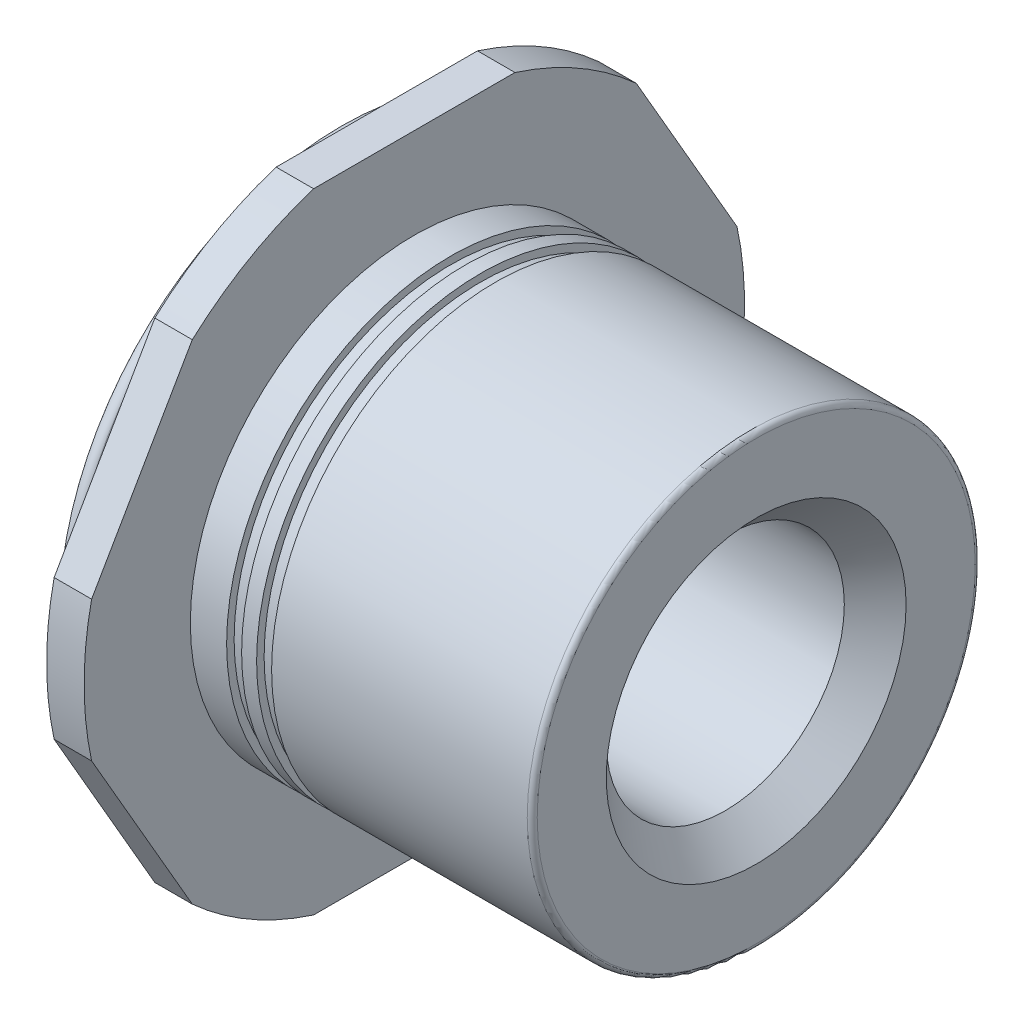
ISO-10303-21;
HEADER;
FILE_DESCRIPTION(('STEP AP214'),'2;1');
FILE_NAME('part.step','',(''),(''),'','','');
FILE_SCHEMA(('AUTOMOTIVE_DESIGN { 1 0 10303 214 1 1 1 1 }'));
ENDSEC;
DATA;
#1=APPLICATION_CONTEXT('core data for automotive mechanical design processes');
#2=APPLICATION_PROTOCOL_DEFINITION('international standard','automotive_design',2000,#1);
#3=PRODUCT_CONTEXT('',#1,'mechanical');
#4=PRODUCT('Part','Part','',(#3));
#5=PRODUCT_RELATED_PRODUCT_CATEGORY('part','',(#4));
#6=PRODUCT_DEFINITION_FORMATION('','',#4);
#7=PRODUCT_DEFINITION_CONTEXT('part definition',#1,'design');
#8=PRODUCT_DEFINITION('design','',#6,#7);
#9=PRODUCT_DEFINITION_SHAPE('','',#8);
#10=(LENGTH_UNIT() NAMED_UNIT(*) SI_UNIT(.MILLI.,.METRE.));
#11=(NAMED_UNIT(*) PLANE_ANGLE_UNIT() SI_UNIT($,.RADIAN.));
#12=(NAMED_UNIT(*) SI_UNIT($,.STERADIAN.) SOLID_ANGLE_UNIT());
#13=UNCERTAINTY_MEASURE_WITH_UNIT(LENGTH_MEASURE(1.E-05),#10,'distance_accuracy_value','');
#14=(GEOMETRIC_REPRESENTATION_CONTEXT(3) GLOBAL_UNCERTAINTY_ASSIGNED_CONTEXT((#13)) GLOBAL_UNIT_ASSIGNED_CONTEXT((#10,
#11,#12)) REPRESENTATION_CONTEXT('',''));
#15=CARTESIAN_POINT('',(0.,0.,0.));
#16=DIRECTION('',(0.,0.,1.));
#17=DIRECTION('',(1.,0.,0.));
#18=AXIS2_PLACEMENT_3D('',#15,#16,#17);
#19=CARTESIAN_POINT('',(-0.5207,2.29362,0.));
#20=DIRECTION('',(-1.,0.,0.));
#21=DIRECTION('',(0.,-1.,0.));
#22=AXIS2_PLACEMENT_3D('',#19,#20,#21);
#23=PLANE('',#22);
#24=DIRECTION('',(0.,0.,1.));
#25=VECTOR('',#24,1.);
#26=CARTESIAN_POINT('',(-0.5207,4.3688,0.));
#27=LINE('',#26,#25);
#28=CARTESIAN_POINT('',(-0.5207,4.3688,-1.39869845842483));
#29=VERTEX_POINT('',#28);
#30=CARTESIAN_POINT('',(-0.5207,4.3688,1.39869845842483));
#31=VERTEX_POINT('',#30);
#32=EDGE_CURVE('E133',#29,#31,#27,.T.);
#33=ORIENTED_EDGE('',*,*,#32,.F.);
#34=CARTESIAN_POINT('',(-0.5207,0.,0.));
#35=DIRECTION('',(-1.,0.,0.));
#36=DIRECTION('',(0.,-1.,0.));
#37=AXIS2_PLACEMENT_3D('',#34,#35,#36);
#38=CIRCLE('',#37,4.58724);
#39=CARTESIAN_POINT('',(-0.5207,3.39570839723005,-3.08414255484103));
#40=VERTEX_POINT('',#39);
#41=EDGE_CURVE('E122',#40,#29,#38,.F.);
#42=ORIENTED_EDGE('',*,*,#41,.F.);
#43=DIRECTION('',(0.,0.866025403784438,0.500000000000001));
#44=VECTOR('',#43,1.);
#45=CARTESIAN_POINT('',(-0.5207,2.1844,-3.78349178405345));
#46=LINE('',#45,#44);
#47=CARTESIAN_POINT('',(-0.5207,0.973091602769959,-4.48284101326587));
#48=VERTEX_POINT('',#47);
#49=EDGE_CURVE('E117',#48,#40,#46,.T.);
#50=ORIENTED_EDGE('',*,*,#49,.F.);
#51=CARTESIAN_POINT('',(-0.5207,0.,0.));
#52=DIRECTION('',(-1.,0.,0.));
#53=DIRECTION('',(0.,-1.,0.));
#54=AXIS2_PLACEMENT_3D('',#51,#52,#53);
#55=CIRCLE('',#54,4.58724);
#56=CARTESIAN_POINT('',(-0.5207,-0.973091602769968,-4.48284101326587));
#57=VERTEX_POINT('',#56);
#58=EDGE_CURVE('E154',#57,#48,#55,.F.);
#59=ORIENTED_EDGE('',*,*,#58,.F.);
#60=DIRECTION('',(0.,0.866025403784439,-0.5));
#61=VECTOR('',#60,1.);
#62=CARTESIAN_POINT('',(-0.5207,-2.1844,-3.78349178405346));
#63=LINE('',#62,#61);
#64=CARTESIAN_POINT('',(-0.5207,-3.39570839723003,-3.08414255484105));
#65=VERTEX_POINT('',#64);
#66=EDGE_CURVE('E155',#65,#57,#63,.T.);
#67=ORIENTED_EDGE('',*,*,#66,.F.);
#68=CARTESIAN_POINT('',(-0.5207,0.,0.));
#69=DIRECTION('',(-1.,0.,0.));
#70=DIRECTION('',(0.,-1.,0.));
#71=AXIS2_PLACEMENT_3D('',#68,#69,#70);
#72=CIRCLE('',#71,4.58724);
#73=CARTESIAN_POINT('',(-0.5207,-4.3688,-1.39869845842483));
#74=VERTEX_POINT('',#73);
#75=EDGE_CURVE('E233',#74,#65,#72,.F.);
#76=ORIENTED_EDGE('',*,*,#75,.F.);
#77=DIRECTION('',(0.,0.,-1.));
#78=VECTOR('',#77,1.);
#79=CARTESIAN_POINT('',(-0.5207,-4.3688,0.));
#80=LINE('',#79,#78);
#81=CARTESIAN_POINT('',(-0.5207,-4.3688,1.39869845842483));
#82=VERTEX_POINT('',#81);
#83=EDGE_CURVE('E161',#82,#74,#80,.T.);
#84=ORIENTED_EDGE('',*,*,#83,.F.);
#85=CARTESIAN_POINT('',(-0.5207,0.,0.));
#86=DIRECTION('',(-1.,0.,0.));
#87=DIRECTION('',(0.,-1.,0.));
#88=AXIS2_PLACEMENT_3D('',#85,#86,#87);
#89=CIRCLE('',#88,4.58724);
#90=CARTESIAN_POINT('',(-0.5207,-3.39570839723003,3.08414255484104));
#91=VERTEX_POINT('',#90);
#92=EDGE_CURVE('E235',#91,#82,#89,.F.);
#93=ORIENTED_EDGE('',*,*,#92,.F.);
#94=DIRECTION('',(0.,-0.866025403784439,-0.5));
#95=VECTOR('',#94,1.);
#96=CARTESIAN_POINT('',(-0.5207,-2.1844,3.78349178405346));
#97=LINE('',#96,#95);
#98=CARTESIAN_POINT('',(-0.5207,-0.973091602769971,4.48284101326587));
#99=VERTEX_POINT('',#98);
#100=EDGE_CURVE('E165',#99,#91,#97,.T.);
#101=ORIENTED_EDGE('',*,*,#100,.F.);
#102=CARTESIAN_POINT('',(-0.5207,0.,0.));
#103=DIRECTION('',(-1.,0.,0.));
#104=DIRECTION('',(0.,-1.,0.));
#105=AXIS2_PLACEMENT_3D('',#102,#103,#104);
#106=CIRCLE('',#105,4.58724);
#107=CARTESIAN_POINT('',(-0.5207,0.97309160276997,4.48284101326587));
#108=VERTEX_POINT('',#107);
#109=EDGE_CURVE('E237',#108,#99,#106,.F.);
#110=ORIENTED_EDGE('',*,*,#109,.F.);
#111=DIRECTION('',(0.,-0.866025403784439,0.5));
#112=VECTOR('',#111,1.);
#113=CARTESIAN_POINT('',(-0.5207,2.1844,3.78349178405346));
#114=LINE('',#113,#112);
#115=CARTESIAN_POINT('',(-0.5207,3.39570839723003,3.08414255484105));
#116=VERTEX_POINT('',#115);
#117=EDGE_CURVE('E169',#116,#108,#114,.T.);
#118=ORIENTED_EDGE('',*,*,#117,.F.);
#119=CARTESIAN_POINT('',(-0.5207,0.,0.));
#120=DIRECTION('',(-1.,0.,0.));
#121=DIRECTION('',(0.,-1.,0.));
#122=AXIS2_PLACEMENT_3D('',#119,#120,#121);
#123=CIRCLE('',#122,4.58724);
#124=EDGE_CURVE('E136',#31,#116,#123,.F.);
#125=ORIENTED_EDGE('',*,*,#124,.F.);
#126=EDGE_LOOP('',(#33,#42,#50,#59,#67,#76,#84,#93,#101,#110,#118,#125));
#127=FACE_BOUND('',#126,.T.);
#128=CARTESIAN_POINT('',(-0.5207,0.,0.));
#129=DIRECTION('',(-1.,0.,0.));
#130=DIRECTION('',(0.,0.,1.));
#131=AXIS2_PLACEMENT_3D('',#128,#129,#130);
#132=CIRCLE('',#131,3.7498428670522);
#133=CARTESIAN_POINT('',(-0.5207,0.,3.7498428670522));
#134=VERTEX_POINT('',#133);
#135=EDGE_CURVE('E160',#134,#134,#132,.T.);
#136=ORIENTED_EDGE('',*,*,#135,.F.);
#137=EDGE_LOOP('',(#136));
#138=FACE_BOUND('',#137,.T.);
#139=ADVANCED_FACE('F18',(#127,#138),#23,.T.);
#140=CARTESIAN_POINT('',(-0.347133333333333,0.,0.));
#141=DIRECTION('',(-1.,0.,0.));
#142=DIRECTION('',(0.,0.,1.));
#143=AXIS2_PLACEMENT_3D('',#140,#141,#142);
#144=CYLINDRICAL_SURFACE('',#143,3.7498428670522);
#145=CARTESIAN_POINT('',(-0.694266666698695,0.,0.));
#146=DIRECTION('',(-1.,0.,0.));
#147=DIRECTION('',(0.,0.,1.));
#148=AXIS2_PLACEMENT_3D('',#145,#146,#147);
#149=CIRCLE('',#148,3.74984286708013);
#150=CARTESIAN_POINT('',(-0.694266666698695,0.,3.74984286708013));
#151=VERTEX_POINT('',#150);
#152=EDGE_CURVE('E150',#151,#151,#149,.T.);
#153=ORIENTED_EDGE('',*,*,#152,.F.);
#154=EDGE_LOOP('',(#153));
#155=FACE_BOUND('',#154,.T.);
#156=ORIENTED_EDGE('',*,*,#135,.T.);
#157=EDGE_LOOP('',(#156));
#158=FACE_BOUND('',#157,.T.);
#159=ADVANCED_FACE('F633',(#155,#158),#144,.T.);
#160=CARTESIAN_POINT('',(-0.26035,2.1844,-3.78349178405345));
#161=DIRECTION('',(0.,0.500000000000001,-0.866025403784438));
#162=DIRECTION('',(0.,0.866025403784438,0.500000000000001));
#163=AXIS2_PLACEMENT_3D('',#160,#161,#162);
#164=PLANE('',#163);
#165=ORIENTED_EDGE('',*,*,#49,.T.);
#166=DIRECTION('',(-1.,0.,0.));
#167=VECTOR('',#166,1.);
#168=CARTESIAN_POINT('',(-0.26035,3.39570839723004,-3.08414255484103));
#169=LINE('',#168,#167);
#170=CARTESIAN_POINT('',(0.,3.39570839723005,-3.08414255484103));
#171=VERTEX_POINT('',#170);
#172=EDGE_CURVE('E129',#171,#40,#169,.T.);
#173=ORIENTED_EDGE('',*,*,#172,.F.);
#174=DIRECTION('',(0.,0.866025403784438,0.500000000000002));
#175=VECTOR('',#174,1.);
#176=CARTESIAN_POINT('',(0.,0.973091602769965,-4.48284101326587));
#177=LINE('',#176,#175);
#178=CARTESIAN_POINT('',(0.,0.973091602769964,-4.48284101326587));
#179=VERTEX_POINT('',#178);
#180=EDGE_CURVE('E153',#179,#171,#177,.T.);
#181=ORIENTED_EDGE('',*,*,#180,.F.);
#182=DIRECTION('',(-1.,0.,0.));
#183=VECTOR('',#182,1.);
#184=CARTESIAN_POINT('',(-0.26035,0.973091602769966,-4.48284101326587));
#185=LINE('',#184,#183);
#186=EDGE_CURVE('E157',#48,#179,#185,.F.);
#187=ORIENTED_EDGE('',*,*,#186,.F.);
#188=EDGE_LOOP('',(#165,#173,#181,#187));
#189=FACE_BOUND('',#188,.T.);
#190=ADVANCED_FACE('F399',(#189),#164,.T.);
#191=CARTESIAN_POINT('',(-0.26035,0.,0.));
#192=DIRECTION('',(-1.,0.,0.));
#193=DIRECTION('',(0.,-1.,0.));
#194=AXIS2_PLACEMENT_3D('',#191,#192,#193);
#195=CYLINDRICAL_SURFACE('',#194,4.58724);
#196=DIRECTION('',(-1.,0.,0.));
#197=VECTOR('',#196,1.);
#198=CARTESIAN_POINT('',(-0.26035,4.3688,-1.39869845842483));
#199=LINE('',#198,#197);
#200=CARTESIAN_POINT('',(0.,4.3688,-1.39869845842483));
#201=VERTEX_POINT('',#200);
#202=EDGE_CURVE('E127',#201,#29,#199,.T.);
#203=ORIENTED_EDGE('',*,*,#202,.F.);
#204=CARTESIAN_POINT('',(0.,0.,0.));
#205=DIRECTION('',(-1.,0.,0.));
#206=DIRECTION('',(0.,-1.,0.));
#207=AXIS2_PLACEMENT_3D('',#204,#205,#206);
#208=CIRCLE('',#207,4.58724);
#209=EDGE_CURVE('E228',#171,#201,#208,.F.);
#210=ORIENTED_EDGE('',*,*,#209,.F.);
#211=ORIENTED_EDGE('',*,*,#172,.T.);
#212=ORIENTED_EDGE('',*,*,#41,.T.);
#213=EDGE_LOOP('',(#203,#210,#211,#212));
#214=FACE_BOUND('',#213,.T.);
#215=ADVANCED_FACE('F124',(#214),#195,.T.);
#216=CARTESIAN_POINT('',(-0.26035,4.3688,0.));
#217=DIRECTION('',(0.,1.,0.));
#218=DIRECTION('',(-1.,0.,0.));
#219=AXIS2_PLACEMENT_3D('',#216,#217,#218);
#220=PLANE('',#219);
#221=ORIENTED_EDGE('',*,*,#32,.T.);
#222=DIRECTION('',(-1.,0.,0.));
#223=VECTOR('',#222,1.);
#224=CARTESIAN_POINT('',(-0.26035,4.3688,1.39869845842483));
#225=LINE('',#224,#223);
#226=CARTESIAN_POINT('',(0.,4.3688,1.39869845842483));
#227=VERTEX_POINT('',#226);
#228=EDGE_CURVE('E139',#227,#31,#225,.T.);
#229=ORIENTED_EDGE('',*,*,#228,.F.);
#230=DIRECTION('',(0.,0.,1.));
#231=VECTOR('',#230,1.);
#232=CARTESIAN_POINT('',(0.,4.3688,0.));
#233=LINE('',#232,#231);
#234=EDGE_CURVE('E143',#201,#227,#233,.T.);
#235=ORIENTED_EDGE('',*,*,#234,.F.);
#236=ORIENTED_EDGE('',*,*,#202,.T.);
#237=EDGE_LOOP('',(#221,#229,#235,#236));
#238=FACE_BOUND('',#237,.T.);
#239=ADVANCED_FACE('F141',(#238),#220,.T.);
#240=CARTESIAN_POINT('',(-0.26035,0.,0.));
#241=DIRECTION('',(-1.,0.,0.));
#242=DIRECTION('',(0.,-1.,0.));
#243=AXIS2_PLACEMENT_3D('',#240,#241,#242);
#244=CYLINDRICAL_SURFACE('',#243,4.58724);
#245=ORIENTED_EDGE('',*,*,#228,.T.);
#246=ORIENTED_EDGE('',*,*,#124,.T.);
#247=DIRECTION('',(1.,0.,0.));
#248=VECTOR('',#247,1.);
#249=CARTESIAN_POINT('',(-0.26035,3.39570839723004,3.08414255484104));
#250=LINE('',#249,#248);
#251=CARTESIAN_POINT('',(0.,3.39570839723004,3.08414255484104));
#252=VERTEX_POINT('',#251);
#253=EDGE_CURVE('E171',#252,#116,#250,.F.);
#254=ORIENTED_EDGE('',*,*,#253,.F.);
#255=CARTESIAN_POINT('',(0.,0.,0.));
#256=DIRECTION('',(-1.,0.,0.));
#257=DIRECTION('',(0.,-1.,0.));
#258=AXIS2_PLACEMENT_3D('',#255,#256,#257);
#259=CIRCLE('',#258,4.58724);
#260=EDGE_CURVE('E225',#227,#252,#259,.F.);
#261=ORIENTED_EDGE('',*,*,#260,.F.);
#262=EDGE_LOOP('',(#245,#246,#254,#261));
#263=FACE_BOUND('',#262,.T.);
#264=ADVANCED_FACE('F388',(#263),#244,.T.);
#265=CARTESIAN_POINT('',(-0.26035,2.1844,3.78349178405346));
#266=DIRECTION('',(0.,0.5,0.866025403784439));
#267=DIRECTION('',(0.,-0.866025403784439,0.5));
#268=AXIS2_PLACEMENT_3D('',#265,#266,#267);
#269=PLANE('',#268);
#270=ORIENTED_EDGE('',*,*,#117,.T.);
#271=DIRECTION('',(-1.,0.,0.));
#272=VECTOR('',#271,1.);
#273=CARTESIAN_POINT('',(-0.26035,0.973091602769963,4.48284101326587));
#274=LINE('',#273,#272);
#275=CARTESIAN_POINT('',(0.,0.973091602769961,4.48284101326587));
#276=VERTEX_POINT('',#275);
#277=EDGE_CURVE('E170',#276,#108,#274,.T.);
#278=ORIENTED_EDGE('',*,*,#277,.F.);
#279=DIRECTION('',(0.,-0.866025403784439,0.499999999999999));
#280=VECTOR('',#279,1.);
#281=CARTESIAN_POINT('',(0.,3.39570839723004,3.08414255484104));
#282=LINE('',#281,#280);
#283=EDGE_CURVE('E224',#252,#276,#282,.T.);
#284=ORIENTED_EDGE('',*,*,#283,.F.);
#285=ORIENTED_EDGE('',*,*,#253,.T.);
#286=EDGE_LOOP('',(#270,#278,#284,#285));
#287=FACE_BOUND('',#286,.T.);
#288=ADVANCED_FACE('F384',(#287),#269,.T.);
#289=CARTESIAN_POINT('',(-0.26035,0.,0.));
#290=DIRECTION('',(-1.,0.,0.));
#291=DIRECTION('',(0.,-1.,0.));
#292=AXIS2_PLACEMENT_3D('',#289,#290,#291);
#293=CYLINDRICAL_SURFACE('',#292,4.58724);
#294=ORIENTED_EDGE('',*,*,#277,.T.);
#295=ORIENTED_EDGE('',*,*,#109,.T.);
#296=DIRECTION('',(1.,0.,0.));
#297=VECTOR('',#296,1.);
#298=CARTESIAN_POINT('',(-0.26035,-0.973091602769967,4.48284101326587));
#299=LINE('',#298,#297);
#300=CARTESIAN_POINT('',(0.,-0.973091602769966,4.48284101326587));
#301=VERTEX_POINT('',#300);
#302=EDGE_CURVE('E168',#301,#99,#299,.F.);
#303=ORIENTED_EDGE('',*,*,#302,.F.);
#304=CARTESIAN_POINT('',(0.,0.,0.));
#305=DIRECTION('',(-1.,0.,0.));
#306=DIRECTION('',(0.,-1.,0.));
#307=AXIS2_PLACEMENT_3D('',#304,#305,#306);
#308=CIRCLE('',#307,4.58724);
#309=EDGE_CURVE('E221',#276,#301,#308,.F.);
#310=ORIENTED_EDGE('',*,*,#309,.F.);
#311=EDGE_LOOP('',(#294,#295,#303,#310));
#312=FACE_BOUND('',#311,.T.);
#313=ADVANCED_FACE('F393',(#312),#293,.T.);
#314=CARTESIAN_POINT('',(-0.26035,-2.1844,3.78349178405346));
#315=DIRECTION('',(0.,-0.5,0.866025403784439));
#316=DIRECTION('',(0.,-0.866025403784439,-0.5));
#317=AXIS2_PLACEMENT_3D('',#314,#315,#316);
#318=PLANE('',#317);
#319=ORIENTED_EDGE('',*,*,#100,.T.);
#320=DIRECTION('',(-1.,0.,0.));
#321=VECTOR('',#320,1.);
#322=CARTESIAN_POINT('',(-0.26035,-3.39570839723004,3.08414255484104));
#323=LINE('',#322,#321);
#324=CARTESIAN_POINT('',(0.,-3.39570839723003,3.08414255484104));
#325=VERTEX_POINT('',#324);
#326=EDGE_CURVE('E167',#325,#91,#323,.T.);
#327=ORIENTED_EDGE('',*,*,#326,.F.);
#328=DIRECTION('',(0.,-0.866025403784439,-0.499999999999999));
#329=VECTOR('',#328,1.);
#330=CARTESIAN_POINT('',(0.,-0.973091602769966,4.48284101326587));
#331=LINE('',#330,#329);
#332=EDGE_CURVE('E220',#301,#325,#331,.T.);
#333=ORIENTED_EDGE('',*,*,#332,.F.);
#334=ORIENTED_EDGE('',*,*,#302,.T.);
#335=EDGE_LOOP('',(#319,#327,#333,#334));
#336=FACE_BOUND('',#335,.T.);
#337=ADVANCED_FACE('F419',(#336),#318,.T.);
#338=CARTESIAN_POINT('',(-0.26035,0.,0.));
#339=DIRECTION('',(-1.,0.,0.));
#340=DIRECTION('',(0.,-1.,0.));
#341=AXIS2_PLACEMENT_3D('',#338,#339,#340);
#342=CYLINDRICAL_SURFACE('',#341,4.58724);
#343=ORIENTED_EDGE('',*,*,#326,.T.);
#344=ORIENTED_EDGE('',*,*,#92,.T.);
#345=DIRECTION('',(1.,0.,0.));
#346=VECTOR('',#345,1.);
#347=CARTESIAN_POINT('',(-0.26035,-4.3688,1.39869845842483));
#348=LINE('',#347,#346);
#349=CARTESIAN_POINT('',(0.,-4.3688,1.39869845842483));
#350=VERTEX_POINT('',#349);
#351=EDGE_CURVE('E164',#350,#82,#348,.F.);
#352=ORIENTED_EDGE('',*,*,#351,.F.);
#353=CARTESIAN_POINT('',(0.,0.,0.));
#354=DIRECTION('',(-1.,0.,0.));
#355=DIRECTION('',(0.,-1.,0.));
#356=AXIS2_PLACEMENT_3D('',#353,#354,#355);
#357=CIRCLE('',#356,4.58724);
#358=EDGE_CURVE('E217',#325,#350,#357,.F.);
#359=ORIENTED_EDGE('',*,*,#358,.F.);
#360=EDGE_LOOP('',(#343,#344,#352,#359));
#361=FACE_BOUND('',#360,.T.);
#362=ADVANCED_FACE('F417',(#361),#342,.T.);
#363=CARTESIAN_POINT('',(-0.26035,-4.3688,0.));
#364=DIRECTION('',(0.,-1.,0.));
#365=DIRECTION('',(0.,0.,-1.));
#366=AXIS2_PLACEMENT_3D('',#363,#364,#365);
#367=PLANE('',#366);
#368=ORIENTED_EDGE('',*,*,#83,.T.);
#369=DIRECTION('',(-1.,0.,0.));
#370=VECTOR('',#369,1.);
#371=CARTESIAN_POINT('',(-0.26035,-4.3688,-1.39869845842483));
#372=LINE('',#371,#370);
#373=CARTESIAN_POINT('',(0.,-4.3688,-1.39869845842483));
#374=VERTEX_POINT('',#373);
#375=EDGE_CURVE('E163',#374,#74,#372,.T.);
#376=ORIENTED_EDGE('',*,*,#375,.F.);
#377=DIRECTION('',(0.,0.,1.));
#378=VECTOR('',#377,1.);
#379=CARTESIAN_POINT('',(0.,-4.3688,0.));
#380=LINE('',#379,#378);
#381=EDGE_CURVE('E216',#350,#374,#380,.F.);
#382=ORIENTED_EDGE('',*,*,#381,.F.);
#383=ORIENTED_EDGE('',*,*,#351,.T.);
#384=EDGE_LOOP('',(#368,#376,#382,#383));
#385=FACE_BOUND('',#384,.T.);
#386=ADVANCED_FACE('F414',(#385),#367,.T.);
#387=CARTESIAN_POINT('',(-0.26035,0.,0.));
#388=DIRECTION('',(-1.,0.,0.));
#389=DIRECTION('',(0.,-1.,0.));
#390=AXIS2_PLACEMENT_3D('',#387,#388,#389);
#391=CYLINDRICAL_SURFACE('',#390,4.58724);
#392=ORIENTED_EDGE('',*,*,#375,.T.);
#393=ORIENTED_EDGE('',*,*,#75,.T.);
#394=DIRECTION('',(1.,0.,0.));
#395=VECTOR('',#394,1.);
#396=CARTESIAN_POINT('',(-0.26035,-3.39570839723004,-3.08414255484104));
#397=LINE('',#396,#395);
#398=CARTESIAN_POINT('',(0.,-3.39570839723004,-3.08414255484104));
#399=VERTEX_POINT('',#398);
#400=EDGE_CURVE('E158',#399,#65,#397,.F.);
#401=ORIENTED_EDGE('',*,*,#400,.F.);
#402=CARTESIAN_POINT('',(0.,0.,0.));
#403=DIRECTION('',(-1.,0.,0.));
#404=DIRECTION('',(0.,-1.,0.));
#405=AXIS2_PLACEMENT_3D('',#402,#403,#404);
#406=CIRCLE('',#405,4.58724);
#407=EDGE_CURVE('E213',#374,#399,#406,.F.);
#408=ORIENTED_EDGE('',*,*,#407,.F.);
#409=EDGE_LOOP('',(#392,#393,#401,#408));
#410=FACE_BOUND('',#409,.T.);
#411=ADVANCED_FACE('F411',(#410),#391,.T.);
#412=CARTESIAN_POINT('',(-0.26035,-2.1844,-3.78349178405346));
#413=DIRECTION('',(0.,-0.5,-0.866025403784439));
#414=DIRECTION('',(0.,0.866025403784439,-0.5));
#415=AXIS2_PLACEMENT_3D('',#412,#413,#414);
#416=PLANE('',#415);
#417=ORIENTED_EDGE('',*,*,#66,.T.);
#418=DIRECTION('',(-1.,0.,0.));
#419=VECTOR('',#418,1.);
#420=CARTESIAN_POINT('',(-0.26035,-0.973091602769961,-4.48284101326587));
#421=LINE('',#420,#419);
#422=CARTESIAN_POINT('',(0.,-0.973091602769957,-4.48284101326587));
#423=VERTEX_POINT('',#422);
#424=EDGE_CURVE('E232',#423,#57,#421,.T.);
#425=ORIENTED_EDGE('',*,*,#424,.F.);
#426=DIRECTION('',(0.,0.866025403784439,-0.499999999999999));
#427=VECTOR('',#426,1.);
#428=CARTESIAN_POINT('',(0.,-3.39570839723004,-3.08414255484104));
#429=LINE('',#428,#427);
#430=EDGE_CURVE('E212',#399,#423,#429,.T.);
#431=ORIENTED_EDGE('',*,*,#430,.F.);
#432=ORIENTED_EDGE('',*,*,#400,.T.);
#433=EDGE_LOOP('',(#417,#425,#431,#432));
#434=FACE_BOUND('',#433,.T.);
#435=ADVANCED_FACE('F408',(#434),#416,.T.);
#436=CARTESIAN_POINT('',(-0.26035,0.,0.));
#437=DIRECTION('',(-1.,0.,0.));
#438=DIRECTION('',(0.,-1.,0.));
#439=AXIS2_PLACEMENT_3D('',#436,#437,#438);
#440=CYLINDRICAL_SURFACE('',#439,4.58724);
#441=ORIENTED_EDGE('',*,*,#424,.T.);
#442=ORIENTED_EDGE('',*,*,#58,.T.);
#443=ORIENTED_EDGE('',*,*,#186,.T.);
#444=CARTESIAN_POINT('',(0.,0.,0.));
#445=DIRECTION('',(-1.,0.,0.));
#446=DIRECTION('',(0.,-1.,0.));
#447=AXIS2_PLACEMENT_3D('',#444,#445,#446);
#448=CIRCLE('',#447,4.58724);
#449=EDGE_CURVE('E209',#423,#179,#448,.F.);
#450=ORIENTED_EDGE('',*,*,#449,.F.);
#451=EDGE_LOOP('',(#441,#442,#443,#450));
#452=FACE_BOUND('',#451,.T.);
#453=ADVANCED_FACE('F401',(#452),#440,.T.);
#454=CARTESIAN_POINT('',(-0.863621899782174,0.,0.));
#455=DIRECTION('',(-1.,0.,0.));
#456=DIRECTION('',(0.,0.,1.));
#457=AXIS2_PLACEMENT_3D('',#454,#455,#456);
#458=CONICAL_SURFACE('',#457,3.91919810016361,0.785398163397448);
#459=CARTESIAN_POINT('',(-0.863621899807235,0.,0.));
#460=DIRECTION('',(-1.,0.,0.));
#461=DIRECTION('',(0.,0.,1.));
#462=AXIS2_PLACEMENT_3D('',#459,#460,#461);
#463=CIRCLE('',#462,3.91919810019277);
#464=CARTESIAN_POINT('',(-0.863621899807235,0.,3.91919810019277));
#465=VERTEX_POINT('',#464);
#466=EDGE_CURVE('E208',#465,#465,#463,.T.);
#467=ORIENTED_EDGE('',*,*,#466,.F.);
#468=EDGE_LOOP('',(#467));
#469=FACE_BOUND('',#468,.T.);
#470=ORIENTED_EDGE('',*,*,#152,.T.);
#471=EDGE_LOOP('',(#470));
#472=FACE_BOUND('',#471,.T.);
#473=ADVANCED_FACE('F494',(#469,#472),#458,.T.);
#474=CARTESIAN_POINT('',(0.,2.29362,0.));
#475=DIRECTION('',(1.,0.,0.));
#476=DIRECTION('',(0.,1.,0.));
#477=AXIS2_PLACEMENT_3D('',#474,#475,#476);
#478=PLANE('',#477);
#479=ORIENTED_EDGE('',*,*,#430,.T.);
#480=ORIENTED_EDGE('',*,*,#449,.T.);
#481=ORIENTED_EDGE('',*,*,#180,.T.);
#482=ORIENTED_EDGE('',*,*,#209,.T.);
#483=ORIENTED_EDGE('',*,*,#234,.T.);
#484=ORIENTED_EDGE('',*,*,#260,.T.);
#485=ORIENTED_EDGE('',*,*,#283,.T.);
#486=ORIENTED_EDGE('',*,*,#309,.T.);
#487=ORIENTED_EDGE('',*,*,#332,.T.);
#488=ORIENTED_EDGE('',*,*,#358,.T.);
#489=ORIENTED_EDGE('',*,*,#381,.T.);
#490=ORIENTED_EDGE('',*,*,#407,.T.);
#491=EDGE_LOOP('',(#479,#480,#481,#482,#483,#484,#485,#486,#487,#488,#489,#490));
#492=FACE_BOUND('',#491,.T.);
#493=CARTESIAN_POINT('',(0.,0.,0.));
#494=DIRECTION('',(-1.,0.,0.));
#495=DIRECTION('',(0.,0.,1.));
#496=AXIS2_PLACEMENT_3D('',#493,#494,#495);
#497=CIRCLE('',#496,3.1115);
#498=CARTESIAN_POINT('',(0.,0.,3.1115));
#499=VERTEX_POINT('',#498);
#500=EDGE_CURVE('E205',#499,#499,#497,.F.);
#501=ORIENTED_EDGE('',*,*,#500,.F.);
#502=EDGE_LOOP('',(#501));
#503=FACE_BOUND('',#502,.T.);
#504=ADVANCED_FACE('F396',(#492,#503),#478,.T.);
#505=CARTESIAN_POINT('',(2.34018666666667,0.,0.));
#506=DIRECTION('',(-1.,0.,0.));
#507=DIRECTION('',(0.,0.,1.));
#508=AXIS2_PLACEMENT_3D('',#505,#506,#507);
#509=CYLINDRICAL_SURFACE('',#508,3.1115);
#510=CARTESIAN_POINT('',(0.50419,0.,0.));
#511=DIRECTION('',(-1.,0.,0.));
#512=DIRECTION('',(0.,0.,1.));
#513=AXIS2_PLACEMENT_3D('',#510,#511,#512);
#514=CIRCLE('',#513,3.1115);
#515=CARTESIAN_POINT('',(0.50419,0.,3.1115));
#516=VERTEX_POINT('',#515);
#517=EDGE_CURVE('E201',#516,#516,#514,.T.);
#518=ORIENTED_EDGE('',*,*,#517,.T.);
#519=EDGE_LOOP('',(#518));
#520=FACE_BOUND('',#519,.T.);
#521=ORIENTED_EDGE('',*,*,#500,.T.);
#522=EDGE_LOOP('',(#521));
#523=FACE_BOUND('',#522,.T.);
#524=ADVANCED_FACE('F341',(#520,#523),#509,.T.);
#525=CARTESIAN_POINT('',(-0.93726,0.,0.));
#526=DIRECTION('',(-1.,0.,0.));
#527=DIRECTION('',(0.,0.,1.));
#528=AXIS2_PLACEMENT_3D('',#525,#526,#527);
#529=TOROIDAL_SURFACE('',#528,3.84556,0.104139999999999);
#530=ORIENTED_EDGE('',*,*,#466,.T.);
#531=EDGE_LOOP('',(#530));
#532=FACE_BOUND('',#531,.T.);
#533=CARTESIAN_POINT('',(-1.0414,0.,0.));
#534=DIRECTION('',(1.,0.,0.));
#535=DIRECTION('',(0.,0.,-1.));
#536=AXIS2_PLACEMENT_3D('',#533,#534,#535);
#537=CIRCLE('',#536,3.84556);
#538=CARTESIAN_POINT('',(-1.0414,0.,3.84556));
#539=VERTEX_POINT('',#538);
#540=CARTESIAN_POINT('',(-1.0414,0.,-3.84556));
#541=VERTEX_POINT('',#540);
#542=EDGE_CURVE('E204',#539,#541,#537,.F.);
#543=ORIENTED_EDGE('',*,*,#542,.F.);
#544=CARTESIAN_POINT('',(-1.0414,0.,0.));
#545=DIRECTION('',(1.,0.,0.));
#546=DIRECTION('',(0.,0.,1.));
#547=AXIS2_PLACEMENT_3D('',#544,#545,#546);
#548=CIRCLE('',#547,3.84556);
#549=EDGE_CURVE('E200',#541,#539,#548,.F.);
#550=ORIENTED_EDGE('',*,*,#549,.F.);
#551=EDGE_LOOP('',(#543,#550));
#552=FACE_BOUND('',#551,.T.);
#553=ADVANCED_FACE('F337',(#532,#552),#529,.T.);
#554=CARTESIAN_POINT('',(0.50419,0.,3.05943));
#555=DIRECTION('',(-1.,0.,0.));
#556=DIRECTION('',(0.,0.,1.));
#557=AXIS2_PLACEMENT_3D('',#554,#555,#556);
#558=PLANE('',#557);
#559=ORIENTED_EDGE('',*,*,#517,.F.);
#560=EDGE_LOOP('',(#559));
#561=FACE_BOUND('',#560,.T.);
#562=CARTESIAN_POINT('',(0.504190000000001,0.,0.));
#563=DIRECTION('',(-1.,0.,0.));
#564=DIRECTION('',(0.,0.,1.));
#565=AXIS2_PLACEMENT_3D('',#562,#563,#564);
#566=CIRCLE('',#565,3.00736);
#567=CARTESIAN_POINT('',(0.504190000000001,0.,3.00736));
#568=VERTEX_POINT('',#567);
#569=EDGE_CURVE('E197',#568,#568,#566,.F.);
#570=ORIENTED_EDGE('',*,*,#569,.F.);
#571=EDGE_LOOP('',(#570));
#572=FACE_BOUND('',#571,.T.);
#573=ADVANCED_FACE('F323',(#561,#572),#558,.F.);
#574=CARTESIAN_POINT('',(-1.0414,0.,1.92278));
#575=DIRECTION('',(-1.,0.,0.));
#576=DIRECTION('',(0.,0.,1.));
#577=AXIS2_PLACEMENT_3D('',#574,#575,#576);
#578=PLANE('',#577);
#579=ORIENTED_EDGE('',*,*,#542,.T.);
#580=ORIENTED_EDGE('',*,*,#549,.T.);
#581=EDGE_LOOP('',(#579,#580));
#582=FACE_BOUND('',#581,.T.);
#583=CARTESIAN_POINT('',(-1.04139999996278,0.,0.));
#584=DIRECTION('',(-1.,0.,0.));
#585=DIRECTION('',(0.,0.,1.));
#586=AXIS2_PLACEMENT_3D('',#583,#584,#585);
#587=CIRCLE('',#586,2.0827999999824);
#588=CARTESIAN_POINT('',(-1.04139999996278,0.,2.0827999999824));
#589=VERTEX_POINT('',#588);
#590=EDGE_CURVE('E194',#589,#589,#587,.F.);
#591=ORIENTED_EDGE('',*,*,#590,.T.);
#592=EDGE_LOOP('',(#591));
#593=FACE_BOUND('',#592,.T.);
#594=ADVANCED_FACE('F312',(#582,#593),#578,.T.);
#595=CARTESIAN_POINT('',(0.60833,0.,0.));
#596=DIRECTION('',(-1.,0.,0.));
#597=DIRECTION('',(0.,0.,1.));
#598=AXIS2_PLACEMENT_3D('',#595,#596,#597);
#599=CYLINDRICAL_SURFACE('',#598,3.00736);
#600=CARTESIAN_POINT('',(0.71247,0.,0.));
#601=DIRECTION('',(-1.,0.,0.));
#602=DIRECTION('',(0.,0.,1.));
#603=AXIS2_PLACEMENT_3D('',#600,#601,#602);
#604=CIRCLE('',#603,3.00736);
#605=CARTESIAN_POINT('',(0.71247,0.,3.00736));
#606=VERTEX_POINT('',#605);
#607=EDGE_CURVE('E191',#606,#606,#604,.T.);
#608=ORIENTED_EDGE('',*,*,#607,.T.);
#609=EDGE_LOOP('',(#608));
#610=FACE_BOUND('',#609,.T.);
#611=ORIENTED_EDGE('',*,*,#569,.T.);
#612=EDGE_LOOP('',(#611));
#613=FACE_BOUND('',#612,.T.);
#614=ADVANCED_FACE('F322',(#610,#613),#599,.T.);
#615=CARTESIAN_POINT('',(-1.04139999990593,0.,0.));
#616=DIRECTION('',(-1.,0.,0.));
#617=DIRECTION('',(0.,0.,1.));
#618=AXIS2_PLACEMENT_3D('',#615,#616,#617);
#619=CONICAL_SURFACE('',#618,2.08279999992556,0.785398163397448);
#620=ORIENTED_EDGE('',*,*,#590,.F.);
#621=EDGE_LOOP('',(#620));
#622=FACE_BOUND('',#621,.T.);
#623=CARTESIAN_POINT('',(-0.61214,0.,0.));
#624=DIRECTION('',(1.,0.,0.));
#625=DIRECTION('',(0.,0.,-1.));
#626=AXIS2_PLACEMENT_3D('',#623,#624,#625);
#627=CIRCLE('',#626,1.65354);
#628=CARTESIAN_POINT('',(-0.61214,0.,-1.65354));
#629=VERTEX_POINT('',#628);
#630=EDGE_CURVE('E190',#629,#629,#627,.T.);
#631=ORIENTED_EDGE('',*,*,#630,.T.);
#632=EDGE_LOOP('',(#631));
#633=FACE_BOUND('',#632,.T.);
#634=ADVANCED_FACE('F468',(#622,#633),#619,.F.);
#635=CARTESIAN_POINT('',(0.71247,0.,3.05943));
#636=DIRECTION('',(1.,0.,0.));
#637=DIRECTION('',(0.,0.,-1.));
#638=AXIS2_PLACEMENT_3D('',#635,#636,#637);
#639=PLANE('',#638);
#640=ORIENTED_EDGE('',*,*,#607,.F.);
#641=EDGE_LOOP('',(#640));
#642=FACE_BOUND('',#641,.T.);
#643=CARTESIAN_POINT('',(0.712470000000001,0.,0.));
#644=DIRECTION('',(-1.,0.,0.));
#645=DIRECTION('',(0.,0.,1.));
#646=AXIS2_PLACEMENT_3D('',#643,#644,#645);
#647=CIRCLE('',#646,3.1115);
#648=CARTESIAN_POINT('',(0.712470000000001,0.,3.1115));
#649=VERTEX_POINT('',#648);
#650=EDGE_CURVE('E187',#649,#649,#647,.F.);
#651=ORIENTED_EDGE('',*,*,#650,.F.);
#652=EDGE_LOOP('',(#651));
#653=FACE_BOUND('',#652,.T.);
#654=ADVANCED_FACE('F466',(#642,#653),#639,.F.);
#655=CARTESIAN_POINT('',(1.8542,0.,0.));
#656=DIRECTION('',(1.,0.,0.));
#657=DIRECTION('',(0.,0.,-1.));
#658=AXIS2_PLACEMENT_3D('',#655,#656,#657);
#659=CYLINDRICAL_SURFACE('',#658,1.65354);
#660=ORIENTED_EDGE('',*,*,#630,.F.);
#661=EDGE_LOOP('',(#660));
#662=FACE_BOUND('',#661,.T.);
#663=CARTESIAN_POINT('',(4.32054000003745,0.,0.));
#664=DIRECTION('',(1.,0.,0.));
#665=DIRECTION('',(0.,0.,1.));
#666=AXIS2_PLACEMENT_3D('',#663,#664,#665);
#667=CIRCLE('',#666,1.65354000000661);
#668=CARTESIAN_POINT('',(4.32054000003745,0.,1.65354000000661));
#669=VERTEX_POINT('',#668);
#670=EDGE_CURVE('E186',#669,#669,#667,.T.);
#671=ORIENTED_EDGE('',*,*,#670,.T.);
#672=EDGE_LOOP('',(#671));
#673=FACE_BOUND('',#672,.T.);
#674=ADVANCED_FACE('F462',(#662,#673),#659,.F.);
#675=CARTESIAN_POINT('',(2.34018666666667,0.,0.));
#676=DIRECTION('',(-1.,0.,0.));
#677=DIRECTION('',(0.,0.,1.));
#678=AXIS2_PLACEMENT_3D('',#675,#676,#677);
#679=CYLINDRICAL_SURFACE('',#678,3.1115);
#680=CARTESIAN_POINT('',(0.92075,0.,0.));
#681=DIRECTION('',(-1.,0.,0.));
#682=DIRECTION('',(0.,0.,1.));
#683=AXIS2_PLACEMENT_3D('',#680,#681,#682);
#684=CIRCLE('',#683,3.1115);
#685=CARTESIAN_POINT('',(0.92075,0.,3.1115));
#686=VERTEX_POINT('',#685);
#687=EDGE_CURVE('E183',#686,#686,#684,.T.);
#688=ORIENTED_EDGE('',*,*,#687,.T.);
#689=EDGE_LOOP('',(#688));
#690=FACE_BOUND('',#689,.T.);
#691=ORIENTED_EDGE('',*,*,#650,.T.);
#692=EDGE_LOOP('',(#691));
#693=FACE_BOUND('',#692,.T.);
#694=ADVANCED_FACE('F456',(#690,#693),#679,.T.);
#695=CARTESIAN_POINT('',(4.74979999995639,0.,0.));
#696=DIRECTION('',(1.,0.,0.));
#697=DIRECTION('',(0.,0.,-1.));
#698=AXIS2_PLACEMENT_3D('',#695,#696,#697);
#699=CONICAL_SURFACE('',#698,2.0827999999824,0.785398163463659);
#700=ORIENTED_EDGE('',*,*,#670,.F.);
#701=EDGE_LOOP('',(#700));
#702=FACE_BOUND('',#701,.T.);
#703=CARTESIAN_POINT('',(4.74979999995639,0.,0.));
#704=DIRECTION('',(1.,0.,0.));
#705=DIRECTION('',(0.,0.,-1.));
#706=AXIS2_PLACEMENT_3D('',#703,#704,#705);
#707=CIRCLE('',#706,2.0827999999824);
#708=CARTESIAN_POINT('',(4.74979999995639,0.,-2.0827999999824));
#709=VERTEX_POINT('',#708);
#710=EDGE_CURVE('E180',#709,#709,#707,.F.);
#711=ORIENTED_EDGE('',*,*,#710,.F.);
#712=EDGE_LOOP('',(#711));
#713=FACE_BOUND('',#712,.T.);
#714=ADVANCED_FACE('F451',(#702,#713),#699,.F.);
#715=CARTESIAN_POINT('',(0.92075,0.,3.05943));
#716=DIRECTION('',(-1.,0.,0.));
#717=DIRECTION('',(0.,0.,1.));
#718=AXIS2_PLACEMENT_3D('',#715,#716,#717);
#719=PLANE('',#718);
#720=ORIENTED_EDGE('',*,*,#687,.F.);
#721=EDGE_LOOP('',(#720));
#722=FACE_BOUND('',#721,.T.);
#723=CARTESIAN_POINT('',(0.920750000000001,0.,0.));
#724=DIRECTION('',(-1.,0.,0.));
#725=DIRECTION('',(0.,0.,1.));
#726=AXIS2_PLACEMENT_3D('',#723,#724,#725);
#727=CIRCLE('',#726,3.00736);
#728=CARTESIAN_POINT('',(0.920750000000001,0.,3.00736));
#729=VERTEX_POINT('',#728);
#730=EDGE_CURVE('E177',#729,#729,#727,.F.);
#731=ORIENTED_EDGE('',*,*,#730,.F.);
#732=EDGE_LOOP('',(#731));
#733=FACE_BOUND('',#732,.T.);
#734=ADVANCED_FACE('F280',(#722,#733),#719,.F.);
#735=CARTESIAN_POINT('',(4.7498,0.,1.52103666666667));
#736=DIRECTION('',(1.,0.,0.));
#737=DIRECTION('',(0.,0.,-1.));
#738=AXIS2_PLACEMENT_3D('',#735,#736,#737);
#739=PLANE('',#738);
#740=CARTESIAN_POINT('',(4.7498,0.,0.));
#741=DIRECTION('',(-1.,0.,0.));
#742=DIRECTION('',(0.,0.,1.));
#743=AXIS2_PLACEMENT_3D('',#740,#741,#742);
#744=CIRCLE('',#743,3.04207333333333);
#745=CARTESIAN_POINT('',(4.7498,0.,3.04207333333333));
#746=VERTEX_POINT('',#745);
#747=CARTESIAN_POINT('',(4.7498,0.,-3.04207333333333));
#748=VERTEX_POINT('',#747);
#749=EDGE_CURVE('E176',#746,#748,#744,.T.);
#750=ORIENTED_EDGE('',*,*,#749,.F.);
#751=CARTESIAN_POINT('',(4.7498,0.,0.));
#752=DIRECTION('',(-1.,0.,0.));
#753=DIRECTION('',(0.,0.,-1.));
#754=AXIS2_PLACEMENT_3D('',#751,#752,#753);
#755=CIRCLE('',#754,3.04207333333333);
#756=EDGE_CURVE('E37',#748,#746,#755,.T.);
#757=ORIENTED_EDGE('',*,*,#756,.F.);
#758=EDGE_LOOP('',(#750,#757));
#759=FACE_BOUND('',#758,.T.);
#760=ORIENTED_EDGE('',*,*,#710,.T.);
#761=EDGE_LOOP('',(#760));
#762=FACE_BOUND('',#761,.T.);
#763=ADVANCED_FACE('F271',(#759,#762),#739,.T.);
#764=CARTESIAN_POINT('',(1.02489,0.,0.));
#765=DIRECTION('',(-1.,0.,0.));
#766=DIRECTION('',(0.,0.,1.));
#767=AXIS2_PLACEMENT_3D('',#764,#765,#766);
#768=CYLINDRICAL_SURFACE('',#767,3.00736);
#769=CARTESIAN_POINT('',(1.12903,0.,0.));
#770=DIRECTION('',(-1.,0.,0.));
#771=DIRECTION('',(0.,0.,1.));
#772=AXIS2_PLACEMENT_3D('',#769,#770,#771);
#773=CIRCLE('',#772,3.00736);
#774=CARTESIAN_POINT('',(1.12903,0.,3.00736));
#775=VERTEX_POINT('',#774);
#776=EDGE_CURVE('E173',#775,#775,#773,.T.);
#777=ORIENTED_EDGE('',*,*,#776,.T.);
#778=EDGE_LOOP('',(#777));
#779=FACE_BOUND('',#778,.T.);
#780=ORIENTED_EDGE('',*,*,#730,.T.);
#781=EDGE_LOOP('',(#780));
#782=FACE_BOUND('',#781,.T.);
#783=ADVANCED_FACE('F259',(#779,#782),#768,.T.);
#784=CARTESIAN_POINT('',(4.68037333333333,0.,0.));
#785=DIRECTION('',(-1.,0.,0.));
#786=DIRECTION('',(0.,0.,1.));
#787=AXIS2_PLACEMENT_3D('',#784,#785,#786);
#788=TOROIDAL_SURFACE('',#787,3.04207333333333,0.0694266666666675);
#789=ORIENTED_EDGE('',*,*,#756,.T.);
#790=ORIENTED_EDGE('',*,*,#749,.T.);
#791=EDGE_LOOP('',(#789,#790));
#792=FACE_BOUND('',#791,.T.);
#793=CARTESIAN_POINT('',(4.68037333333333,0.,0.));
#794=DIRECTION('',(-1.,0.,0.));
#795=DIRECTION('',(0.,0.,1.));
#796=AXIS2_PLACEMENT_3D('',#793,#794,#795);
#797=CIRCLE('',#796,3.1115);
#798=CARTESIAN_POINT('',(4.68037333333333,0.,3.1115));
#799=VERTEX_POINT('',#798);
#800=EDGE_CURVE('E29',#799,#799,#797,.T.);
#801=ORIENTED_EDGE('',*,*,#800,.F.);
#802=EDGE_LOOP('',(#801));
#803=FACE_BOUND('',#802,.T.);
#804=ADVANCED_FACE('F247',(#792,#803),#788,.T.);
#805=CARTESIAN_POINT('',(1.12903,0.,3.05943));
#806=DIRECTION('',(1.,0.,0.));
#807=DIRECTION('',(0.,0.,-1.));
#808=AXIS2_PLACEMENT_3D('',#805,#806,#807);
#809=PLANE('',#808);
#810=ORIENTED_EDGE('',*,*,#776,.F.);
#811=EDGE_LOOP('',(#810));
#812=FACE_BOUND('',#811,.T.);
#813=CARTESIAN_POINT('',(1.12903,0.,0.));
#814=DIRECTION('',(-1.,0.,0.));
#815=DIRECTION('',(0.,0.,1.));
#816=AXIS2_PLACEMENT_3D('',#813,#814,#815);
#817=CIRCLE('',#816,3.1115);
#818=CARTESIAN_POINT('',(1.12903,0.,3.1115));
#819=VERTEX_POINT('',#818);
#820=EDGE_CURVE('E11',#819,#819,#817,.F.);
#821=ORIENTED_EDGE('',*,*,#820,.F.);
#822=EDGE_LOOP('',(#821));
#823=FACE_BOUND('',#822,.T.);
#824=ADVANCED_FACE('F258',(#812,#823),#809,.F.);
#825=CARTESIAN_POINT('',(2.34018666666667,0.,0.));
#826=DIRECTION('',(-1.,0.,0.));
#827=DIRECTION('',(0.,0.,1.));
#828=AXIS2_PLACEMENT_3D('',#825,#826,#827);
#829=CYLINDRICAL_SURFACE('',#828,3.1115);
#830=ORIENTED_EDGE('',*,*,#800,.T.);
#831=EDGE_LOOP('',(#830));
#832=FACE_BOUND('',#831,.T.);
#833=ORIENTED_EDGE('',*,*,#820,.T.);
#834=EDGE_LOOP('',(#833));
#835=FACE_BOUND('',#834,.T.);
#836=ADVANCED_FACE('F429',(#832,#835),#829,.T.);
#837=CLOSED_SHELL('',(#139,#159,#190,#215,#239,#264,#288,#313,#337,#362,#386,#411,#435,#453,
#473,#504,#524,#553,#573,#594,#614,#634,#654,#674,#694,#714,#734,#763,#783,#804,#824,#836));
#838=MANIFOLD_SOLID_BREP('B1',#837);
#839=ADVANCED_BREP_SHAPE_REPRESENTATION('',(#18,#838),#14);
#840=SHAPE_DEFINITION_REPRESENTATION(#9,#839);
ENDSEC;
END-ISO-10303-21;
